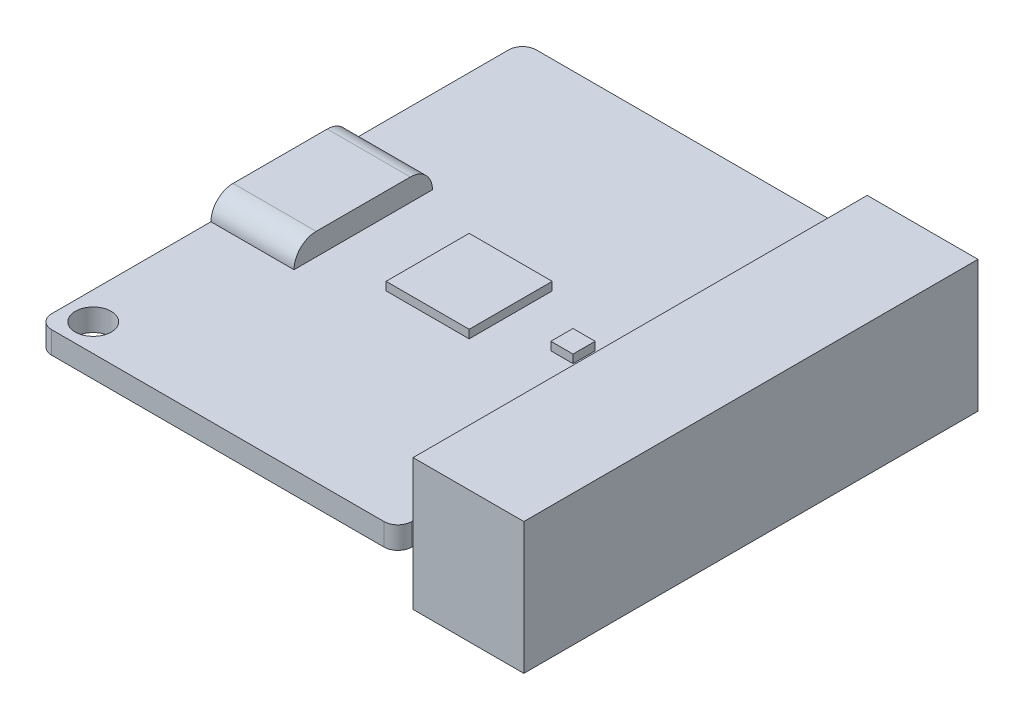
ISO-10303-21;
HEADER;
FILE_DESCRIPTION(('STEP AP214'),'2;1');
FILE_NAME('part.step','',(''),(''),'','','');
FILE_SCHEMA(('AUTOMOTIVE_DESIGN { 1 0 10303 214 1 1 1 1 }'));
ENDSEC;
DATA;
#1=APPLICATION_CONTEXT('core data for automotive mechanical design processes');
#2=APPLICATION_PROTOCOL_DEFINITION('international standard','automotive_design',2000,#1);
#3=PRODUCT_CONTEXT('',#1,'mechanical');
#4=PRODUCT('Part','Part','',(#3));
#5=PRODUCT_RELATED_PRODUCT_CATEGORY('part','',(#4));
#6=PRODUCT_DEFINITION_FORMATION('','',#4);
#7=PRODUCT_DEFINITION_CONTEXT('part definition',#1,'design');
#8=PRODUCT_DEFINITION('design','',#6,#7);
#9=PRODUCT_DEFINITION_SHAPE('','',#8);
#10=(LENGTH_UNIT() NAMED_UNIT(*) SI_UNIT(.MILLI.,.METRE.));
#11=(NAMED_UNIT(*) PLANE_ANGLE_UNIT() SI_UNIT($,.RADIAN.));
#12=(NAMED_UNIT(*) SI_UNIT($,.STERADIAN.) SOLID_ANGLE_UNIT());
#13=UNCERTAINTY_MEASURE_WITH_UNIT(LENGTH_MEASURE(1.E-05),#10,'distance_accuracy_value','');
#14=(GEOMETRIC_REPRESENTATION_CONTEXT(3) GLOBAL_UNCERTAINTY_ASSIGNED_CONTEXT((#13)) GLOBAL_UNIT_ASSIGNED_CONTEXT((#10,
#11,#12)) REPRESENTATION_CONTEXT('',''));
#15=CARTESIAN_POINT('',(0.,0.,0.));
#16=DIRECTION('',(0.,0.,1.));
#17=DIRECTION('',(1.,0.,0.));
#18=AXIS2_PLACEMENT_3D('',#15,#16,#17);
#19=CARTESIAN_POINT('',(13.,1.6,16.5));
#20=DIRECTION('',(-1.,0.,0.));
#21=DIRECTION('',(0.,0.,1.));
#22=AXIS2_PLACEMENT_3D('',#19,#20,#21);
#23=PLANE('',#22);
#24=DIRECTION('',(0.,1.,0.));
#25=VECTOR('',#24,1.);
#26=CARTESIAN_POINT('',(13.,1.6,-16.4));
#27=LINE('',#26,#25);
#28=CARTESIAN_POINT('',(13.,0.,-16.4));
#29=VERTEX_POINT('',#28);
#30=CARTESIAN_POINT('',(13.,1.6,-16.4));
#31=VERTEX_POINT('',#30);
#32=EDGE_CURVE('E11',#29,#31,#27,.T.);
#33=ORIENTED_EDGE('',*,*,#32,.F.);
#34=DIRECTION('',(0.,0.,-1.));
#35=VECTOR('',#34,1.);
#36=CARTESIAN_POINT('',(13.,0.,16.5));
#37=LINE('',#36,#35);
#38=CARTESIAN_POINT('',(13.,0.,-16.5));
#39=VERTEX_POINT('',#38);
#40=EDGE_CURVE('E380',#29,#39,#37,.T.);
#41=ORIENTED_EDGE('',*,*,#40,.T.);
#42=DIRECTION('',(0.,-1.,0.));
#43=VECTOR('',#42,1.);
#44=CARTESIAN_POINT('',(13.,1.6,-16.5));
#45=LINE('',#44,#43);
#46=CARTESIAN_POINT('',(13.,1.6,-16.5));
#47=VERTEX_POINT('',#46);
#48=EDGE_CURVE('E392',#47,#39,#45,.T.);
#49=ORIENTED_EDGE('',*,*,#48,.F.);
#50=DIRECTION('',(0.,0.,-1.));
#51=VECTOR('',#50,1.);
#52=CARTESIAN_POINT('',(13.,1.6,16.5));
#53=LINE('',#52,#51);
#54=EDGE_CURVE('E52',#31,#47,#53,.T.);
#55=ORIENTED_EDGE('',*,*,#54,.F.);
#56=EDGE_LOOP('',(#33,#41,#49,#55));
#57=FACE_BOUND('',#56,.T.);
#58=ADVANCED_FACE('F37',(#57),#23,.F.);
#59=DIRECTION('',(0.,-1.,0.));
#60=VECTOR('',#59,1.);
#61=CARTESIAN_POINT('',(13.,1.6,16.4));
#62=LINE('',#61,#60);
#63=CARTESIAN_POINT('',(13.,1.6,16.4));
#64=VERTEX_POINT('',#63);
#65=CARTESIAN_POINT('',(13.,0.,16.4));
#66=VERTEX_POINT('',#65);
#67=EDGE_CURVE('E45',#64,#66,#62,.T.);
#68=ORIENTED_EDGE('',*,*,#67,.F.);
#69=CARTESIAN_POINT('',(13.,1.6,16.5));
#70=VERTEX_POINT('',#69);
#71=EDGE_CURVE('E362',#70,#64,#53,.T.);
#72=ORIENTED_EDGE('',*,*,#71,.F.);
#73=DIRECTION('',(0.,-1.,0.));
#74=VECTOR('',#73,1.);
#75=CARTESIAN_POINT('',(13.,1.6,16.5));
#76=LINE('',#75,#74);
#77=CARTESIAN_POINT('',(13.,0.,16.5));
#78=VERTEX_POINT('',#77);
#79=EDGE_CURVE('E395',#70,#78,#76,.T.);
#80=ORIENTED_EDGE('',*,*,#79,.T.);
#81=EDGE_CURVE('E381',#78,#66,#37,.T.);
#82=ORIENTED_EDGE('',*,*,#81,.T.);
#83=EDGE_LOOP('',(#68,#72,#80,#82));
#84=FACE_BOUND('',#83,.T.);
#85=ADVANCED_FACE('F463',(#84),#23,.F.);
#86=CARTESIAN_POINT('',(-12.,1.6,-16.5));
#87=DIRECTION('',(0.,-1.,0.));
#88=DIRECTION('',(0.,0.,-1.));
#89=AXIS2_PLACEMENT_3D('',#86,#87,#88);
#90=PLANE('',#89);
#91=DIRECTION('',(0.,0.,1.));
#92=VECTOR('',#91,1.);
#93=CARTESIAN_POINT('',(-2.35000000000001,1.6,-3.));
#94=LINE('',#93,#92);
#95=CARTESIAN_POINT('',(-2.35000000000001,1.6,-3.));
#96=VERTEX_POINT('',#95);
#97=CARTESIAN_POINT('',(-2.35,1.6,3.));
#98=VERTEX_POINT('',#97);
#99=EDGE_CURVE('E274',#96,#98,#94,.T.);
#100=ORIENTED_EDGE('',*,*,#99,.F.);
#101=DIRECTION('',(-1.,0.,0.));
#102=VECTOR('',#101,1.);
#103=CARTESIAN_POINT('',(3.65,1.6,-3.));
#104=LINE('',#103,#102);
#105=CARTESIAN_POINT('',(3.65,1.6,-3.));
#106=VERTEX_POINT('',#105);
#107=EDGE_CURVE('E279',#106,#96,#104,.T.);
#108=ORIENTED_EDGE('',*,*,#107,.F.);
#109=DIRECTION('',(0.,0.,-1.));
#110=VECTOR('',#109,1.);
#111=CARTESIAN_POINT('',(3.65,1.6,-3.));
#112=LINE('',#111,#110);
#113=CARTESIAN_POINT('',(3.65,1.6,3.));
#114=VERTEX_POINT('',#113);
#115=EDGE_CURVE('E291',#114,#106,#112,.T.);
#116=ORIENTED_EDGE('',*,*,#115,.F.);
#117=DIRECTION('',(1.,0.,0.));
#118=VECTOR('',#117,1.);
#119=CARTESIAN_POINT('',(3.65,1.6,3.));
#120=LINE('',#119,#118);
#121=EDGE_CURVE('E288',#98,#114,#120,.T.);
#122=ORIENTED_EDGE('',*,*,#121,.F.);
#123=EDGE_LOOP('',(#100,#108,#116,#122));
#124=FACE_BOUND('',#123,.T.);
#125=DIRECTION('',(0.,0.,1.));
#126=VECTOR('',#125,1.);
#127=CARTESIAN_POINT('',(-13.,1.6,16.5));
#128=LINE('',#127,#126);
#129=CARTESIAN_POINT('',(-13.,1.6,-16.5));
#130=VERTEX_POINT('',#129);
#131=CARTESIAN_POINT('',(-13.,1.6,-5.));
#132=VERTEX_POINT('',#131);
#133=EDGE_CURVE('E354',#130,#132,#128,.T.);
#134=ORIENTED_EDGE('',*,*,#133,.T.);
#135=DIRECTION('',(-1.,0.,0.));
#136=VECTOR('',#135,1.);
#137=CARTESIAN_POINT('',(-7.00000000000001,1.6,-5.));
#138=LINE('',#137,#136);
#139=CARTESIAN_POINT('',(-7.00000000000001,1.6,-5.));
#140=VERTEX_POINT('',#139);
#141=EDGE_CURVE('E331',#132,#140,#138,.F.);
#142=ORIENTED_EDGE('',*,*,#141,.T.);
#143=DIRECTION('',(0.,0.,-1.));
#144=VECTOR('',#143,1.);
#145=CARTESIAN_POINT('',(-7.00000000000001,1.6,-16.5));
#146=LINE('',#145,#144);
#147=CARTESIAN_POINT('',(-7.00000000000001,1.6,5.));
#148=VERTEX_POINT('',#147);
#149=EDGE_CURVE('E333',#148,#140,#146,.T.);
#150=ORIENTED_EDGE('',*,*,#149,.F.);
#151=DIRECTION('',(-1.,0.,0.));
#152=VECTOR('',#151,1.);
#153=CARTESIAN_POINT('',(-7.00000000000001,1.6,5.));
#154=LINE('',#153,#152);
#155=CARTESIAN_POINT('',(-13.,1.6,5.));
#156=VERTEX_POINT('',#155);
#157=EDGE_CURVE('E326',#148,#156,#154,.T.);
#158=ORIENTED_EDGE('',*,*,#157,.T.);
#159=CARTESIAN_POINT('',(-13.,1.6,16.5));
#160=VERTEX_POINT('',#159);
#161=EDGE_CURVE('E352',#156,#160,#128,.T.);
#162=ORIENTED_EDGE('',*,*,#161,.T.);
#163=CARTESIAN_POINT('',(-12.,1.6,16.5));
#164=DIRECTION('',(0.,1.,0.));
#165=DIRECTION('',(0.,0.,-1.));
#166=AXIS2_PLACEMENT_3D('',#163,#164,#165);
#167=CIRCLE('',#166,1.);
#168=CARTESIAN_POINT('',(-12.,1.6,17.5));
#169=VERTEX_POINT('',#168);
#170=EDGE_CURVE('E356',#160,#169,#167,.T.);
#171=ORIENTED_EDGE('',*,*,#170,.T.);
#172=DIRECTION('',(1.,0.,0.));
#173=VECTOR('',#172,1.);
#174=CARTESIAN_POINT('',(-12.,1.6,17.5));
#175=LINE('',#174,#173);
#176=CARTESIAN_POINT('',(12.,1.6,17.5));
#177=VERTEX_POINT('',#176);
#178=EDGE_CURVE('E358',#169,#177,#175,.T.);
#179=ORIENTED_EDGE('',*,*,#178,.T.);
#180=CARTESIAN_POINT('',(12.,1.6,16.5));
#181=DIRECTION('',(0.,1.,0.));
#182=DIRECTION('',(0.,0.,1.));
#183=AXIS2_PLACEMENT_3D('',#180,#181,#182);
#184=CIRCLE('',#183,1.);
#185=EDGE_CURVE('E360',#177,#70,#184,.T.);
#186=ORIENTED_EDGE('',*,*,#185,.T.);
#187=ORIENTED_EDGE('',*,*,#71,.T.);
#188=EDGE_CURVE('E365',#64,#31,#53,.T.);
#189=ORIENTED_EDGE('',*,*,#188,.T.);
#190=ORIENTED_EDGE('',*,*,#54,.T.);
#191=CARTESIAN_POINT('',(12.,1.6,-16.5));
#192=DIRECTION('',(0.,1.,0.));
#193=DIRECTION('',(0.,0.,-1.));
#194=AXIS2_PLACEMENT_3D('',#191,#192,#193);
#195=CIRCLE('',#194,1.);
#196=CARTESIAN_POINT('',(12.,1.6,-17.5));
#197=VERTEX_POINT('',#196);
#198=EDGE_CURVE('E364',#47,#197,#195,.T.);
#199=ORIENTED_EDGE('',*,*,#198,.T.);
#200=DIRECTION('',(-1.,0.,0.));
#201=VECTOR('',#200,1.);
#202=CARTESIAN_POINT('',(-12.,1.6,-17.5));
#203=LINE('',#202,#201);
#204=CARTESIAN_POINT('',(-12.,1.6,-17.5));
#205=VERTEX_POINT('',#204);
#206=EDGE_CURVE('E367',#197,#205,#203,.T.);
#207=ORIENTED_EDGE('',*,*,#206,.T.);
#208=CARTESIAN_POINT('',(-12.,1.6,-16.5));
#209=DIRECTION('',(0.,1.,0.));
#210=DIRECTION('',(0.,0.,-1.));
#211=AXIS2_PLACEMENT_3D('',#208,#209,#210);
#212=CIRCLE('',#211,1.);
#213=EDGE_CURVE('E349',#205,#130,#212,.T.);
#214=ORIENTED_EDGE('',*,*,#213,.T.);
#215=EDGE_LOOP('',(#134,#142,#150,#158,#162,#171,#179,#186,#187,#189,#190,#199,#207,#214));
#216=FACE_BOUND('',#215,.T.);
#217=CARTESIAN_POINT('',(-11.,1.6,15.5));
#218=DIRECTION('',(0.,1.,0.));
#219=DIRECTION('',(0.,0.,1.));
#220=AXIS2_PLACEMENT_3D('',#217,#218,#219);
#221=CIRCLE('',#220,1.3);
#222=CARTESIAN_POINT('',(-11.,1.6,16.8));
#223=VERTEX_POINT('',#222);
#224=EDGE_CURVE('E343',#223,#223,#221,.T.);
#225=ORIENTED_EDGE('',*,*,#224,.F.);
#226=EDGE_LOOP('',(#225));
#227=FACE_BOUND('',#226,.T.);
#228=CARTESIAN_POINT('',(11.,1.6,-15.5));
#229=DIRECTION('',(0.,1.,0.));
#230=DIRECTION('',(0.,0.,1.));
#231=AXIS2_PLACEMENT_3D('',#228,#229,#230);
#232=CIRCLE('',#231,1.3);
#233=CARTESIAN_POINT('',(11.,1.6,-14.2));
#234=VERTEX_POINT('',#233);
#235=EDGE_CURVE('E337',#234,#234,#232,.T.);
#236=ORIENTED_EDGE('',*,*,#235,.F.);
#237=EDGE_LOOP('',(#236));
#238=FACE_BOUND('',#237,.T.);
#239=DIRECTION('',(0.,0.,1.));
#240=VECTOR('',#239,1.);
#241=CARTESIAN_POINT('',(7.34999999999999,1.6,-0.8));
#242=LINE('',#241,#240);
#243=CARTESIAN_POINT('',(7.34999999999999,1.6,-0.8));
#244=VERTEX_POINT('',#243);
#245=CARTESIAN_POINT('',(7.34999999999999,1.6,0.799999999999997));
#246=VERTEX_POINT('',#245);
#247=EDGE_CURVE('E236',#244,#246,#242,.T.);
#248=ORIENTED_EDGE('',*,*,#247,.F.);
#249=DIRECTION('',(-1.,0.,0.));
#250=VECTOR('',#249,1.);
#251=CARTESIAN_POINT('',(8.94999999999999,1.6,-0.8));
#252=LINE('',#251,#250);
#253=CARTESIAN_POINT('',(8.94999999999999,1.6,-0.8));
#254=VERTEX_POINT('',#253);
#255=EDGE_CURVE('E249',#254,#244,#252,.T.);
#256=ORIENTED_EDGE('',*,*,#255,.F.);
#257=DIRECTION('',(0.,0.,-1.));
#258=VECTOR('',#257,1.);
#259=CARTESIAN_POINT('',(8.94999999999999,1.6,-0.8));
#260=LINE('',#259,#258);
#261=CARTESIAN_POINT('',(8.95,1.6,0.799999999999999));
#262=VERTEX_POINT('',#261);
#263=EDGE_CURVE('E258',#262,#254,#260,.T.);
#264=ORIENTED_EDGE('',*,*,#263,.F.);
#265=DIRECTION('',(1.,0.,0.));
#266=VECTOR('',#265,1.);
#267=CARTESIAN_POINT('',(8.94999999999999,1.6,0.8));
#268=LINE('',#267,#266);
#269=EDGE_CURVE('E239',#246,#262,#268,.T.);
#270=ORIENTED_EDGE('',*,*,#269,.F.);
#271=EDGE_LOOP('',(#248,#256,#264,#270));
#272=FACE_BOUND('',#271,.T.);
#273=ADVANCED_FACE('F458',(#124,#216,#227,#238,#272),#90,.F.);
#274=CARTESIAN_POINT('',(-12.,0.,-16.5));
#275=DIRECTION('',(0.,-1.,0.));
#276=DIRECTION('',(0.,0.,-1.));
#277=AXIS2_PLACEMENT_3D('',#274,#275,#276);
#278=PLANE('',#277);
#279=CARTESIAN_POINT('',(-12.,0.,16.5));
#280=DIRECTION('',(0.,1.,0.));
#281=DIRECTION('',(0.,0.,-1.));
#282=AXIS2_PLACEMENT_3D('',#279,#280,#281);
#283=CIRCLE('',#282,1.);
#284=CARTESIAN_POINT('',(-13.,0.,16.5));
#285=VERTEX_POINT('',#284);
#286=CARTESIAN_POINT('',(-12.,0.,17.5));
#287=VERTEX_POINT('',#286);
#288=EDGE_CURVE('E374',#285,#287,#283,.T.);
#289=ORIENTED_EDGE('',*,*,#288,.F.);
#290=DIRECTION('',(0.,0.,1.));
#291=VECTOR('',#290,1.);
#292=CARTESIAN_POINT('',(-13.,0.,16.5));
#293=LINE('',#292,#291);
#294=CARTESIAN_POINT('',(-13.,0.,-16.5));
#295=VERTEX_POINT('',#294);
#296=EDGE_CURVE('E372',#295,#285,#293,.T.);
#297=ORIENTED_EDGE('',*,*,#296,.F.);
#298=CARTESIAN_POINT('',(-12.,0.,-16.5));
#299=DIRECTION('',(0.,1.,0.));
#300=DIRECTION('',(0.,0.,-1.));
#301=AXIS2_PLACEMENT_3D('',#298,#299,#300);
#302=CIRCLE('',#301,1.);
#303=CARTESIAN_POINT('',(-12.,0.,-17.5));
#304=VERTEX_POINT('',#303);
#305=EDGE_CURVE('E346',#304,#295,#302,.T.);
#306=ORIENTED_EDGE('',*,*,#305,.F.);
#307=DIRECTION('',(-1.,0.,0.));
#308=VECTOR('',#307,1.);
#309=CARTESIAN_POINT('',(-12.,0.,-17.5));
#310=LINE('',#309,#308);
#311=CARTESIAN_POINT('',(12.,0.,-17.5));
#312=VERTEX_POINT('',#311);
#313=EDGE_CURVE('E353',#312,#304,#310,.T.);
#314=ORIENTED_EDGE('',*,*,#313,.F.);
#315=CARTESIAN_POINT('',(12.,0.,-16.5));
#316=DIRECTION('',(0.,1.,0.));
#317=DIRECTION('',(0.,0.,-1.));
#318=AXIS2_PLACEMENT_3D('',#315,#316,#317);
#319=CIRCLE('',#318,1.);
#320=EDGE_CURVE('E383',#39,#312,#319,.T.);
#321=ORIENTED_EDGE('',*,*,#320,.F.);
#322=ORIENTED_EDGE('',*,*,#40,.F.);
#323=EDGE_CURVE('E384',#66,#29,#37,.T.);
#324=ORIENTED_EDGE('',*,*,#323,.F.);
#325=ORIENTED_EDGE('',*,*,#81,.F.);
#326=CARTESIAN_POINT('',(12.,0.,16.5));
#327=DIRECTION('',(0.,1.,0.));
#328=DIRECTION('',(0.,0.,1.));
#329=AXIS2_PLACEMENT_3D('',#326,#327,#328);
#330=CIRCLE('',#329,1.);
#331=CARTESIAN_POINT('',(12.,0.,17.5));
#332=VERTEX_POINT('',#331);
#333=EDGE_CURVE('E378',#332,#78,#330,.T.);
#334=ORIENTED_EDGE('',*,*,#333,.F.);
#335=DIRECTION('',(1.,0.,0.));
#336=VECTOR('',#335,1.);
#337=CARTESIAN_POINT('',(-12.,0.,17.5));
#338=LINE('',#337,#336);
#339=EDGE_CURVE('E376',#287,#332,#338,.T.);
#340=ORIENTED_EDGE('',*,*,#339,.F.);
#341=EDGE_LOOP('',(#289,#297,#306,#314,#321,#322,#324,#325,#334,#340));
#342=FACE_BOUND('',#341,.T.);
#343=CARTESIAN_POINT('',(-11.,0.,15.5));
#344=DIRECTION('',(0.,1.,0.));
#345=DIRECTION('',(0.,0.,1.));
#346=AXIS2_PLACEMENT_3D('',#343,#344,#345);
#347=CIRCLE('',#346,1.3);
#348=CARTESIAN_POINT('',(-11.,0.,16.8));
#349=VERTEX_POINT('',#348);
#350=EDGE_CURVE('E340',#349,#349,#347,.T.);
#351=ORIENTED_EDGE('',*,*,#350,.T.);
#352=EDGE_LOOP('',(#351));
#353=FACE_BOUND('',#352,.T.);
#354=CARTESIAN_POINT('',(11.,0.,-15.5));
#355=DIRECTION('',(0.,1.,0.));
#356=DIRECTION('',(0.,0.,1.));
#357=AXIS2_PLACEMENT_3D('',#354,#355,#356);
#358=CIRCLE('',#357,1.3);
#359=CARTESIAN_POINT('',(11.,0.,-14.2));
#360=VERTEX_POINT('',#359);
#361=EDGE_CURVE('E336',#360,#360,#358,.T.);
#362=ORIENTED_EDGE('',*,*,#361,.T.);
#363=EDGE_LOOP('',(#362));
#364=FACE_BOUND('',#363,.T.);
#365=ADVANCED_FACE('F443',(#342,#353,#364),#278,.T.);
#366=CARTESIAN_POINT('',(-12.,1.6,-16.5));
#367=DIRECTION('',(0.,-1.,0.));
#368=DIRECTION('',(0.,0.,-1.));
#369=AXIS2_PLACEMENT_3D('',#366,#367,#368);
#370=CYLINDRICAL_SURFACE('',#369,1.);
#371=ORIENTED_EDGE('',*,*,#305,.T.);
#372=DIRECTION('',(0.,-1.,0.));
#373=VECTOR('',#372,1.);
#374=CARTESIAN_POINT('',(-13.,1.6,-16.5));
#375=LINE('',#374,#373);
#376=EDGE_CURVE('E407',#130,#295,#375,.T.);
#377=ORIENTED_EDGE('',*,*,#376,.F.);
#378=ORIENTED_EDGE('',*,*,#213,.F.);
#379=DIRECTION('',(0.,-1.,0.));
#380=VECTOR('',#379,1.);
#381=CARTESIAN_POINT('',(-12.,1.6,-17.5));
#382=LINE('',#381,#380);
#383=EDGE_CURVE('E369',#205,#304,#382,.T.);
#384=ORIENTED_EDGE('',*,*,#383,.T.);
#385=EDGE_LOOP('',(#371,#377,#378,#384));
#386=FACE_BOUND('',#385,.T.);
#387=ADVANCED_FACE('F39',(#386),#370,.T.);
#388=CARTESIAN_POINT('',(-13.,1.6,16.5));
#389=DIRECTION('',(1.,0.,0.));
#390=DIRECTION('',(0.,0.,-1.));
#391=AXIS2_PLACEMENT_3D('',#388,#389,#390);
#392=PLANE('',#391);
#393=ORIENTED_EDGE('',*,*,#161,.F.);
#394=CARTESIAN_POINT('',(-13.,1.6,3.4));
#395=DIRECTION('',(-1.,0.,0.));
#396=DIRECTION('',(0.,0.,1.));
#397=AXIS2_PLACEMENT_3D('',#394,#395,#396);
#398=CIRCLE('',#397,1.6);
#399=CARTESIAN_POINT('',(-13.,3.2,3.4));
#400=VERTEX_POINT('',#399);
#401=EDGE_CURVE('E320',#156,#400,#398,.T.);
#402=ORIENTED_EDGE('',*,*,#401,.T.);
#403=DIRECTION('',(0.,0.,-1.));
#404=VECTOR('',#403,1.);
#405=CARTESIAN_POINT('',(-13.,3.2,-3.4));
#406=LINE('',#405,#404);
#407=CARTESIAN_POINT('',(-13.,3.2,-3.4));
#408=VERTEX_POINT('',#407);
#409=EDGE_CURVE('E312',#400,#408,#406,.T.);
#410=ORIENTED_EDGE('',*,*,#409,.T.);
#411=CARTESIAN_POINT('',(-13.,1.6,-3.4));
#412=DIRECTION('',(-1.,0.,0.));
#413=DIRECTION('',(0.,0.,1.));
#414=AXIS2_PLACEMENT_3D('',#411,#412,#413);
#415=CIRCLE('',#414,1.6);
#416=EDGE_CURVE('E307',#408,#132,#415,.T.);
#417=ORIENTED_EDGE('',*,*,#416,.T.);
#418=ORIENTED_EDGE('',*,*,#133,.F.);
#419=ORIENTED_EDGE('',*,*,#376,.T.);
#420=ORIENTED_EDGE('',*,*,#296,.T.);
#421=DIRECTION('',(0.,-1.,0.));
#422=VECTOR('',#421,1.);
#423=CARTESIAN_POINT('',(-13.,1.6,16.5));
#424=LINE('',#423,#422);
#425=EDGE_CURVE('E404',#160,#285,#424,.T.);
#426=ORIENTED_EDGE('',*,*,#425,.F.);
#427=EDGE_LOOP('',(#393,#402,#410,#417,#418,#419,#420,#426));
#428=FACE_BOUND('',#427,.T.);
#429=ADVANCED_FACE('F478',(#428),#392,.F.);
#430=CARTESIAN_POINT('',(-12.,1.6,16.5));
#431=DIRECTION('',(0.,-1.,0.));
#432=DIRECTION('',(0.,0.,-1.));
#433=AXIS2_PLACEMENT_3D('',#430,#431,#432);
#434=CYLINDRICAL_SURFACE('',#433,1.);
#435=ORIENTED_EDGE('',*,*,#288,.T.);
#436=DIRECTION('',(0.,-1.,0.));
#437=VECTOR('',#436,1.);
#438=CARTESIAN_POINT('',(-12.,1.6,17.5));
#439=LINE('',#438,#437);
#440=EDGE_CURVE('E401',#169,#287,#439,.T.);
#441=ORIENTED_EDGE('',*,*,#440,.F.);
#442=ORIENTED_EDGE('',*,*,#170,.F.);
#443=ORIENTED_EDGE('',*,*,#425,.T.);
#444=EDGE_LOOP('',(#435,#441,#442,#443));
#445=FACE_BOUND('',#444,.T.);
#446=ADVANCED_FACE('F475',(#445),#434,.T.);
#447=CARTESIAN_POINT('',(-12.,1.6,17.5));
#448=DIRECTION('',(0.,0.,-1.));
#449=DIRECTION('',(-1.,0.,0.));
#450=AXIS2_PLACEMENT_3D('',#447,#448,#449);
#451=PLANE('',#450);
#452=ORIENTED_EDGE('',*,*,#339,.T.);
#453=DIRECTION('',(0.,-1.,0.));
#454=VECTOR('',#453,1.);
#455=CARTESIAN_POINT('',(12.,1.6,17.5));
#456=LINE('',#455,#454);
#457=EDGE_CURVE('E398',#177,#332,#456,.T.);
#458=ORIENTED_EDGE('',*,*,#457,.F.);
#459=ORIENTED_EDGE('',*,*,#178,.F.);
#460=ORIENTED_EDGE('',*,*,#440,.T.);
#461=EDGE_LOOP('',(#452,#458,#459,#460));
#462=FACE_BOUND('',#461,.T.);
#463=ADVANCED_FACE('F471',(#462),#451,.F.);
#464=CARTESIAN_POINT('',(12.,1.6,16.5));
#465=DIRECTION('',(0.,-1.,0.));
#466=DIRECTION('',(0.,0.,-1.));
#467=AXIS2_PLACEMENT_3D('',#464,#465,#466);
#468=CYLINDRICAL_SURFACE('',#467,1.);
#469=ORIENTED_EDGE('',*,*,#333,.T.);
#470=ORIENTED_EDGE('',*,*,#79,.F.);
#471=ORIENTED_EDGE('',*,*,#185,.F.);
#472=ORIENTED_EDGE('',*,*,#457,.T.);
#473=EDGE_LOOP('',(#469,#470,#471,#472));
#474=FACE_BOUND('',#473,.T.);
#475=ADVANCED_FACE('F467',(#474),#468,.T.);
#476=CARTESIAN_POINT('',(12.,1.6,-16.5));
#477=DIRECTION('',(0.,-1.,0.));
#478=DIRECTION('',(0.,0.,-1.));
#479=AXIS2_PLACEMENT_3D('',#476,#477,#478);
#480=CYLINDRICAL_SURFACE('',#479,1.);
#481=ORIENTED_EDGE('',*,*,#320,.T.);
#482=DIRECTION('',(0.,-1.,0.));
#483=VECTOR('',#482,1.);
#484=CARTESIAN_POINT('',(12.,1.6,-17.5));
#485=LINE('',#484,#483);
#486=EDGE_CURVE('E389',#197,#312,#485,.T.);
#487=ORIENTED_EDGE('',*,*,#486,.F.);
#488=ORIENTED_EDGE('',*,*,#198,.F.);
#489=ORIENTED_EDGE('',*,*,#48,.T.);
#490=EDGE_LOOP('',(#481,#487,#488,#489));
#491=FACE_BOUND('',#490,.T.);
#492=ADVANCED_FACE('F450',(#491),#480,.T.);
#493=CARTESIAN_POINT('',(-12.,1.6,-17.5));
#494=DIRECTION('',(0.,0.,1.));
#495=DIRECTION('',(1.,0.,0.));
#496=AXIS2_PLACEMENT_3D('',#493,#494,#495);
#497=PLANE('',#496);
#498=ORIENTED_EDGE('',*,*,#313,.T.);
#499=ORIENTED_EDGE('',*,*,#383,.F.);
#500=ORIENTED_EDGE('',*,*,#206,.F.);
#501=ORIENTED_EDGE('',*,*,#486,.T.);
#502=EDGE_LOOP('',(#498,#499,#500,#501));
#503=FACE_BOUND('',#502,.T.);
#504=ADVANCED_FACE('F454',(#503),#497,.F.);
#505=CARTESIAN_POINT('',(-11.,1.6,15.5));
#506=DIRECTION('',(0.,-1.,0.));
#507=DIRECTION('',(0.,0.,-1.));
#508=AXIS2_PLACEMENT_3D('',#505,#506,#507);
#509=CYLINDRICAL_SURFACE('',#508,1.3);
#510=ORIENTED_EDGE('',*,*,#224,.T.);
#511=EDGE_LOOP('',(#510));
#512=FACE_BOUND('',#511,.T.);
#513=ORIENTED_EDGE('',*,*,#350,.F.);
#514=EDGE_LOOP('',(#513));
#515=FACE_BOUND('',#514,.T.);
#516=ADVANCED_FACE('F522',(#512,#515),#509,.F.);
#517=CARTESIAN_POINT('',(11.,1.6,-15.5));
#518=DIRECTION('',(0.,-1.,0.));
#519=DIRECTION('',(0.,0.,-1.));
#520=AXIS2_PLACEMENT_3D('',#517,#518,#519);
#521=CYLINDRICAL_SURFACE('',#520,1.3);
#522=ORIENTED_EDGE('',*,*,#235,.T.);
#523=EDGE_LOOP('',(#522));
#524=FACE_BOUND('',#523,.T.);
#525=ORIENTED_EDGE('',*,*,#361,.F.);
#526=EDGE_LOOP('',(#525));
#527=FACE_BOUND('',#526,.T.);
#528=ADVANCED_FACE('F528',(#524,#527),#521,.F.);
#529=CARTESIAN_POINT('',(-7.00000000000001,1.6,-3.4));
#530=DIRECTION('',(-1.,0.,0.));
#531=DIRECTION('',(0.,0.,1.));
#532=AXIS2_PLACEMENT_3D('',#529,#530,#531);
#533=PLANE('',#532);
#534=CARTESIAN_POINT('',(-7.00000000000001,1.6,3.4));
#535=DIRECTION('',(-1.,0.,0.));
#536=DIRECTION('',(0.,0.,1.));
#537=AXIS2_PLACEMENT_3D('',#534,#535,#536);
#538=CIRCLE('',#537,1.6);
#539=CARTESIAN_POINT('',(-7.00000000000001,3.2,3.4));
#540=VERTEX_POINT('',#539);
#541=EDGE_CURVE('E311',#148,#540,#538,.T.);
#542=ORIENTED_EDGE('',*,*,#541,.F.);
#543=ORIENTED_EDGE('',*,*,#149,.T.);
#544=CARTESIAN_POINT('',(-7.00000000000001,1.6,-3.4));
#545=DIRECTION('',(-1.,0.,0.));
#546=DIRECTION('',(0.,0.,1.));
#547=AXIS2_PLACEMENT_3D('',#544,#545,#546);
#548=CIRCLE('',#547,1.6);
#549=CARTESIAN_POINT('',(-7.00000000000001,3.2,-3.4));
#550=VERTEX_POINT('',#549);
#551=EDGE_CURVE('E308',#550,#140,#548,.T.);
#552=ORIENTED_EDGE('',*,*,#551,.F.);
#553=DIRECTION('',(0.,0.,-1.));
#554=VECTOR('',#553,1.);
#555=CARTESIAN_POINT('',(-7.00000000000001,3.2,-3.4));
#556=LINE('',#555,#554);
#557=EDGE_CURVE('E314',#540,#550,#556,.T.);
#558=ORIENTED_EDGE('',*,*,#557,.F.);
#559=EDGE_LOOP('',(#542,#543,#552,#558));
#560=FACE_BOUND('',#559,.T.);
#561=ADVANCED_FACE('F536',(#560),#533,.F.);
#562=CARTESIAN_POINT('',(-7.00000000000001,1.6,-3.4));
#563=DIRECTION('',(-1.,0.,0.));
#564=DIRECTION('',(0.,0.,1.));
#565=AXIS2_PLACEMENT_3D('',#562,#563,#564);
#566=CYLINDRICAL_SURFACE('',#565,1.6);
#567=ORIENTED_EDGE('',*,*,#141,.F.);
#568=ORIENTED_EDGE('',*,*,#416,.F.);
#569=DIRECTION('',(-1.,0.,0.));
#570=VECTOR('',#569,1.);
#571=CARTESIAN_POINT('',(-7.00000000000001,3.2,-3.4));
#572=LINE('',#571,#570);
#573=EDGE_CURVE('E324',#550,#408,#572,.T.);
#574=ORIENTED_EDGE('',*,*,#573,.F.);
#575=ORIENTED_EDGE('',*,*,#551,.T.);
#576=EDGE_LOOP('',(#567,#568,#574,#575));
#577=FACE_BOUND('',#576,.T.);
#578=ADVANCED_FACE('F544',(#577),#566,.T.);
#579=CARTESIAN_POINT('',(-7.00000000000001,1.6,3.4));
#580=DIRECTION('',(-1.,0.,0.));
#581=DIRECTION('',(0.,0.,1.));
#582=AXIS2_PLACEMENT_3D('',#579,#580,#581);
#583=CYLINDRICAL_SURFACE('',#582,1.6);
#584=ORIENTED_EDGE('',*,*,#157,.F.);
#585=ORIENTED_EDGE('',*,*,#541,.T.);
#586=DIRECTION('',(-1.,0.,0.));
#587=VECTOR('',#586,1.);
#588=CARTESIAN_POINT('',(-7.00000000000001,3.2,3.4));
#589=LINE('',#588,#587);
#590=EDGE_CURVE('E317',#540,#400,#589,.T.);
#591=ORIENTED_EDGE('',*,*,#590,.T.);
#592=ORIENTED_EDGE('',*,*,#401,.F.);
#593=EDGE_LOOP('',(#584,#585,#591,#592));
#594=FACE_BOUND('',#593,.T.);
#595=ADVANCED_FACE('F552',(#594),#583,.T.);
#596=CARTESIAN_POINT('',(-7.00000000000001,3.2,-3.4));
#597=DIRECTION('',(0.,1.,0.));
#598=DIRECTION('',(0.,0.,1.));
#599=AXIS2_PLACEMENT_3D('',#596,#597,#598);
#600=PLANE('',#599);
#601=ORIENTED_EDGE('',*,*,#409,.F.);
#602=ORIENTED_EDGE('',*,*,#590,.F.);
#603=ORIENTED_EDGE('',*,*,#557,.T.);
#604=ORIENTED_EDGE('',*,*,#573,.T.);
#605=EDGE_LOOP('',(#601,#602,#603,#604));
#606=FACE_BOUND('',#605,.T.);
#607=ADVANCED_FACE('F560',(#606),#600,.T.);
#608=CARTESIAN_POINT('',(-2.35000000000001,2.2,-3.));
#609=DIRECTION('',(1.,0.,0.));
#610=DIRECTION('',(0.,0.,-1.));
#611=AXIS2_PLACEMENT_3D('',#608,#609,#610);
#612=PLANE('',#611);
#613=ORIENTED_EDGE('',*,*,#99,.T.);
#614=DIRECTION('',(0.,-1.,0.));
#615=VECTOR('',#614,1.);
#616=CARTESIAN_POINT('',(-2.35,2.2,3.));
#617=LINE('',#616,#615);
#618=CARTESIAN_POINT('',(-2.35,2.2,3.));
#619=VERTEX_POINT('',#618);
#620=EDGE_CURVE('E304',#619,#98,#617,.T.);
#621=ORIENTED_EDGE('',*,*,#620,.F.);
#622=DIRECTION('',(0.,0.,1.));
#623=VECTOR('',#622,1.);
#624=CARTESIAN_POINT('',(-2.35000000000001,2.2,-3.));
#625=LINE('',#624,#623);
#626=CARTESIAN_POINT('',(-2.35000000000001,2.2,-3.));
#627=VERTEX_POINT('',#626);
#628=EDGE_CURVE('E275',#627,#619,#625,.T.);
#629=ORIENTED_EDGE('',*,*,#628,.F.);
#630=DIRECTION('',(0.,-1.,0.));
#631=VECTOR('',#630,1.);
#632=CARTESIAN_POINT('',(-2.35000000000001,2.2,-3.));
#633=LINE('',#632,#631);
#634=EDGE_CURVE('E285',#627,#96,#633,.T.);
#635=ORIENTED_EDGE('',*,*,#634,.T.);
#636=EDGE_LOOP('',(#613,#621,#629,#635));
#637=FACE_BOUND('',#636,.T.);
#638=ADVANCED_FACE('F568',(#637),#612,.F.);
#639=CARTESIAN_POINT('',(3.65,2.2,3.));
#640=DIRECTION('',(0.,0.,-1.));
#641=DIRECTION('',(-1.,0.,0.));
#642=AXIS2_PLACEMENT_3D('',#639,#640,#641);
#643=PLANE('',#642);
#644=ORIENTED_EDGE('',*,*,#121,.T.);
#645=DIRECTION('',(0.,-1.,0.));
#646=VECTOR('',#645,1.);
#647=CARTESIAN_POINT('',(3.65,2.2,3.));
#648=LINE('',#647,#646);
#649=CARTESIAN_POINT('',(3.65,2.2,3.));
#650=VERTEX_POINT('',#649);
#651=EDGE_CURVE('E301',#650,#114,#648,.T.);
#652=ORIENTED_EDGE('',*,*,#651,.F.);
#653=DIRECTION('',(1.,0.,0.));
#654=VECTOR('',#653,1.);
#655=CARTESIAN_POINT('',(3.65,2.2,3.));
#656=LINE('',#655,#654);
#657=EDGE_CURVE('E278',#619,#650,#656,.T.);
#658=ORIENTED_EDGE('',*,*,#657,.F.);
#659=ORIENTED_EDGE('',*,*,#620,.T.);
#660=EDGE_LOOP('',(#644,#652,#658,#659));
#661=FACE_BOUND('',#660,.T.);
#662=ADVANCED_FACE('F576',(#661),#643,.F.);
#663=CARTESIAN_POINT('',(3.65,2.2,-3.));
#664=DIRECTION('',(-1.,0.,0.));
#665=DIRECTION('',(0.,0.,1.));
#666=AXIS2_PLACEMENT_3D('',#663,#664,#665);
#667=PLANE('',#666);
#668=ORIENTED_EDGE('',*,*,#115,.T.);
#669=DIRECTION('',(0.,-1.,0.));
#670=VECTOR('',#669,1.);
#671=CARTESIAN_POINT('',(3.65,2.2,-3.));
#672=LINE('',#671,#670);
#673=CARTESIAN_POINT('',(3.65,2.2,-3.));
#674=VERTEX_POINT('',#673);
#675=EDGE_CURVE('E298',#674,#106,#672,.T.);
#676=ORIENTED_EDGE('',*,*,#675,.F.);
#677=DIRECTION('',(0.,0.,-1.));
#678=VECTOR('',#677,1.);
#679=CARTESIAN_POINT('',(3.65,2.2,-3.));
#680=LINE('',#679,#678);
#681=EDGE_CURVE('E281',#650,#674,#680,.T.);
#682=ORIENTED_EDGE('',*,*,#681,.F.);
#683=ORIENTED_EDGE('',*,*,#651,.T.);
#684=EDGE_LOOP('',(#668,#676,#682,#683));
#685=FACE_BOUND('',#684,.T.);
#686=ADVANCED_FACE('F584',(#685),#667,.F.);
#687=CARTESIAN_POINT('',(3.65,2.2,-3.));
#688=DIRECTION('',(0.,0.,1.));
#689=DIRECTION('',(1.,0.,0.));
#690=AXIS2_PLACEMENT_3D('',#687,#688,#689);
#691=PLANE('',#690);
#692=ORIENTED_EDGE('',*,*,#107,.T.);
#693=ORIENTED_EDGE('',*,*,#634,.F.);
#694=DIRECTION('',(-1.,0.,0.));
#695=VECTOR('',#694,1.);
#696=CARTESIAN_POINT('',(3.65,2.2,-3.));
#697=LINE('',#696,#695);
#698=EDGE_CURVE('E283',#674,#627,#697,.T.);
#699=ORIENTED_EDGE('',*,*,#698,.F.);
#700=ORIENTED_EDGE('',*,*,#675,.T.);
#701=EDGE_LOOP('',(#692,#693,#699,#700));
#702=FACE_BOUND('',#701,.T.);
#703=ADVANCED_FACE('F592',(#702),#691,.F.);
#704=CARTESIAN_POINT('',(0.,2.2,0.));
#705=DIRECTION('',(0.,-1.,0.));
#706=DIRECTION('',(0.,0.,-1.));
#707=AXIS2_PLACEMENT_3D('',#704,#705,#706);
#708=PLANE('',#707);
#709=ORIENTED_EDGE('',*,*,#628,.T.);
#710=ORIENTED_EDGE('',*,*,#657,.T.);
#711=ORIENTED_EDGE('',*,*,#681,.T.);
#712=ORIENTED_EDGE('',*,*,#698,.T.);
#713=EDGE_LOOP('',(#709,#710,#711,#712));
#714=FACE_BOUND('',#713,.T.);
#715=ADVANCED_FACE('F600',(#714),#708,.F.);
#716=CARTESIAN_POINT('',(7.34999999999999,2.2,-0.8));
#717=DIRECTION('',(1.,0.,0.));
#718=DIRECTION('',(0.,0.,-1.));
#719=AXIS2_PLACEMENT_3D('',#716,#717,#718);
#720=PLANE('',#719);
#721=ORIENTED_EDGE('',*,*,#247,.T.);
#722=DIRECTION('',(0.,-1.,0.));
#723=VECTOR('',#722,1.);
#724=CARTESIAN_POINT('',(7.34999999999999,2.2,0.8));
#725=LINE('',#724,#723);
#726=CARTESIAN_POINT('',(7.34999999999999,2.2,0.8));
#727=VERTEX_POINT('',#726);
#728=EDGE_CURVE('E271',#727,#246,#725,.T.);
#729=ORIENTED_EDGE('',*,*,#728,.F.);
#730=DIRECTION('',(0.,0.,1.));
#731=VECTOR('',#730,1.);
#732=CARTESIAN_POINT('',(7.34999999999999,2.2,-0.8));
#733=LINE('',#732,#731);
#734=CARTESIAN_POINT('',(7.34999999999999,2.2,-0.8));
#735=VERTEX_POINT('',#734);
#736=EDGE_CURVE('E245',#735,#727,#733,.T.);
#737=ORIENTED_EDGE('',*,*,#736,.F.);
#738=DIRECTION('',(0.,-1.,0.));
#739=VECTOR('',#738,1.);
#740=CARTESIAN_POINT('',(7.34999999999999,2.2,-0.8));
#741=LINE('',#740,#739);
#742=EDGE_CURVE('E254',#735,#244,#741,.T.);
#743=ORIENTED_EDGE('',*,*,#742,.T.);
#744=EDGE_LOOP('',(#721,#729,#737,#743));
#745=FACE_BOUND('',#744,.T.);
#746=ADVANCED_FACE('F608',(#745),#720,.F.);
#747=CARTESIAN_POINT('',(8.94999999999999,2.2,0.8));
#748=DIRECTION('',(0.,0.,-1.));
#749=DIRECTION('',(-1.,0.,0.));
#750=AXIS2_PLACEMENT_3D('',#747,#748,#749);
#751=PLANE('',#750);
#752=ORIENTED_EDGE('',*,*,#269,.T.);
#753=DIRECTION('',(0.,-1.,0.));
#754=VECTOR('',#753,1.);
#755=CARTESIAN_POINT('',(8.94999999999999,2.2,0.8));
#756=LINE('',#755,#754);
#757=CARTESIAN_POINT('',(8.94999999999999,2.2,0.8));
#758=VERTEX_POINT('',#757);
#759=EDGE_CURVE('E268',#758,#262,#756,.T.);
#760=ORIENTED_EDGE('',*,*,#759,.F.);
#761=DIRECTION('',(1.,0.,0.));
#762=VECTOR('',#761,1.);
#763=CARTESIAN_POINT('',(8.94999999999999,2.2,0.8));
#764=LINE('',#763,#762);
#765=EDGE_CURVE('E248',#727,#758,#764,.T.);
#766=ORIENTED_EDGE('',*,*,#765,.F.);
#767=ORIENTED_EDGE('',*,*,#728,.T.);
#768=EDGE_LOOP('',(#752,#760,#766,#767));
#769=FACE_BOUND('',#768,.T.);
#770=ADVANCED_FACE('F616',(#769),#751,.F.);
#771=CARTESIAN_POINT('',(8.94999999999999,2.2,-0.8));
#772=DIRECTION('',(-1.,0.,0.));
#773=DIRECTION('',(0.,0.,1.));
#774=AXIS2_PLACEMENT_3D('',#771,#772,#773);
#775=PLANE('',#774);
#776=ORIENTED_EDGE('',*,*,#263,.T.);
#777=DIRECTION('',(0.,-1.,0.));
#778=VECTOR('',#777,1.);
#779=CARTESIAN_POINT('',(8.94999999999999,2.2,-0.8));
#780=LINE('',#779,#778);
#781=CARTESIAN_POINT('',(8.94999999999999,2.2,-0.8));
#782=VERTEX_POINT('',#781);
#783=EDGE_CURVE('E265',#782,#254,#780,.T.);
#784=ORIENTED_EDGE('',*,*,#783,.F.);
#785=DIRECTION('',(0.,0.,-1.));
#786=VECTOR('',#785,1.);
#787=CARTESIAN_POINT('',(8.94999999999999,2.2,-0.8));
#788=LINE('',#787,#786);
#789=EDGE_CURVE('E251',#758,#782,#788,.T.);
#790=ORIENTED_EDGE('',*,*,#789,.F.);
#791=ORIENTED_EDGE('',*,*,#759,.T.);
#792=EDGE_LOOP('',(#776,#784,#790,#791));
#793=FACE_BOUND('',#792,.T.);
#794=ADVANCED_FACE('F624',(#793),#775,.F.);
#795=CARTESIAN_POINT('',(8.94999999999999,2.2,-0.8));
#796=DIRECTION('',(0.,0.,1.));
#797=DIRECTION('',(1.,0.,0.));
#798=AXIS2_PLACEMENT_3D('',#795,#796,#797);
#799=PLANE('',#798);
#800=ORIENTED_EDGE('',*,*,#255,.T.);
#801=ORIENTED_EDGE('',*,*,#742,.F.);
#802=DIRECTION('',(-1.,0.,0.));
#803=VECTOR('',#802,1.);
#804=CARTESIAN_POINT('',(8.94999999999999,2.2,-0.8));
#805=LINE('',#804,#803);
#806=EDGE_CURVE('E253',#782,#735,#805,.T.);
#807=ORIENTED_EDGE('',*,*,#806,.F.);
#808=ORIENTED_EDGE('',*,*,#783,.T.);
#809=EDGE_LOOP('',(#800,#801,#807,#808));
#810=FACE_BOUND('',#809,.T.);
#811=ADVANCED_FACE('F632',(#810),#799,.F.);
#812=CARTESIAN_POINT('',(0.,2.2,0.));
#813=DIRECTION('',(0.,-1.,0.));
#814=DIRECTION('',(0.,0.,-1.));
#815=AXIS2_PLACEMENT_3D('',#812,#813,#814);
#816=PLANE('',#815);
#817=ORIENTED_EDGE('',*,*,#736,.T.);
#818=ORIENTED_EDGE('',*,*,#765,.T.);
#819=ORIENTED_EDGE('',*,*,#789,.T.);
#820=ORIENTED_EDGE('',*,*,#806,.T.);
#821=EDGE_LOOP('',(#817,#818,#819,#820));
#822=FACE_BOUND('',#821,.T.);
#823=ADVANCED_FACE('F640',(#822),#816,.F.);
#824=CARTESIAN_POINT('',(13.,0.,0.));
#825=DIRECTION('',(-1.,0.,0.));
#826=DIRECTION('',(0.,0.,1.));
#827=AXIS2_PLACEMENT_3D('',#824,#825,#826);
#828=PLANE('',#827);
#829=ORIENTED_EDGE('',*,*,#188,.F.);
#830=DIRECTION('',(0.,-1.,0.));
#831=VECTOR('',#830,1.);
#832=CARTESIAN_POINT('',(13.,-3.95,16.4));
#833=LINE('',#832,#831);
#834=CARTESIAN_POINT('',(13.,5.55,16.4));
#835=VERTEX_POINT('',#834);
#836=EDGE_CURVE('E417',#835,#64,#833,.T.);
#837=ORIENTED_EDGE('',*,*,#836,.F.);
#838=DIRECTION('',(0.,0.,1.));
#839=VECTOR('',#838,1.);
#840=CARTESIAN_POINT('',(13.,5.55,16.4));
#841=LINE('',#840,#839);
#842=CARTESIAN_POINT('',(13.,5.55,-16.4));
#843=VERTEX_POINT('',#842);
#844=EDGE_CURVE('E422',#843,#835,#841,.T.);
#845=ORIENTED_EDGE('',*,*,#844,.F.);
#846=DIRECTION('',(0.,1.,0.));
#847=VECTOR('',#846,1.);
#848=CARTESIAN_POINT('',(13.,-3.95,-16.4));
#849=LINE('',#848,#847);
#850=EDGE_CURVE('E234',#31,#843,#849,.T.);
#851=ORIENTED_EDGE('',*,*,#850,.F.);
#852=EDGE_LOOP('',(#829,#837,#845,#851));
#853=FACE_BOUND('',#852,.T.);
#854=ADVANCED_FACE('F438',(#853),#828,.T.);
#855=CARTESIAN_POINT('',(21.,-3.95,-16.4));
#856=DIRECTION('',(0.,0.,1.));
#857=DIRECTION('',(1.,0.,0.));
#858=AXIS2_PLACEMENT_3D('',#855,#856,#857);
#859=PLANE('',#858);
#860=CARTESIAN_POINT('',(13.,-3.95,-16.4));
#861=VERTEX_POINT('',#860);
#862=EDGE_CURVE('E434',#861,#29,#849,.T.);
#863=ORIENTED_EDGE('',*,*,#862,.T.);
#864=ORIENTED_EDGE('',*,*,#32,.T.);
#865=ORIENTED_EDGE('',*,*,#850,.T.);
#866=DIRECTION('',(-1.,0.,0.));
#867=VECTOR('',#866,1.);
#868=CARTESIAN_POINT('',(21.,5.55,-16.4));
#869=LINE('',#868,#867);
#870=CARTESIAN_POINT('',(21.,5.55,-16.4));
#871=VERTEX_POINT('',#870);
#872=EDGE_CURVE('E214',#871,#843,#869,.T.);
#873=ORIENTED_EDGE('',*,*,#872,.F.);
#874=DIRECTION('',(0.,1.,0.));
#875=VECTOR('',#874,1.);
#876=CARTESIAN_POINT('',(21.,-3.95,-16.4));
#877=LINE('',#876,#875);
#878=CARTESIAN_POINT('',(21.,-3.95,-16.4));
#879=VERTEX_POINT('',#878);
#880=EDGE_CURVE('E220',#879,#871,#877,.T.);
#881=ORIENTED_EDGE('',*,*,#880,.F.);
#882=DIRECTION('',(-1.,0.,0.));
#883=VECTOR('',#882,1.);
#884=CARTESIAN_POINT('',(21.,-3.95,-16.4));
#885=LINE('',#884,#883);
#886=EDGE_CURVE('E426',#879,#861,#885,.T.);
#887=ORIENTED_EDGE('',*,*,#886,.T.);
#888=EDGE_LOOP('',(#863,#864,#865,#873,#881,#887));
#889=FACE_BOUND('',#888,.T.);
#890=ADVANCED_FACE('F232',(#889),#859,.F.);
#891=CARTESIAN_POINT('',(21.,5.55,16.4));
#892=DIRECTION('',(0.,-1.,0.));
#893=DIRECTION('',(0.,0.,-1.));
#894=AXIS2_PLACEMENT_3D('',#891,#892,#893);
#895=PLANE('',#894);
#896=ORIENTED_EDGE('',*,*,#844,.T.);
#897=DIRECTION('',(-1.,0.,0.));
#898=VECTOR('',#897,1.);
#899=CARTESIAN_POINT('',(21.,5.55,16.4));
#900=LINE('',#899,#898);
#901=CARTESIAN_POINT('',(21.,5.55,16.4));
#902=VERTEX_POINT('',#901);
#903=EDGE_CURVE('E216',#902,#835,#900,.T.);
#904=ORIENTED_EDGE('',*,*,#903,.F.);
#905=DIRECTION('',(0.,0.,1.));
#906=VECTOR('',#905,1.);
#907=CARTESIAN_POINT('',(21.,5.55,16.4));
#908=LINE('',#907,#906);
#909=EDGE_CURVE('E210',#871,#902,#908,.T.);
#910=ORIENTED_EDGE('',*,*,#909,.F.);
#911=ORIENTED_EDGE('',*,*,#872,.T.);
#912=EDGE_LOOP('',(#896,#904,#910,#911));
#913=FACE_BOUND('',#912,.T.);
#914=ADVANCED_FACE('F212',(#913),#895,.F.);
#915=CARTESIAN_POINT('',(21.,-3.95,16.4));
#916=DIRECTION('',(0.,0.,-1.));
#917=DIRECTION('',(-1.,0.,0.));
#918=AXIS2_PLACEMENT_3D('',#915,#916,#917);
#919=PLANE('',#918);
#920=ORIENTED_EDGE('',*,*,#836,.T.);
#921=ORIENTED_EDGE('',*,*,#67,.T.);
#922=CARTESIAN_POINT('',(13.,-3.95,16.4));
#923=VERTEX_POINT('',#922);
#924=EDGE_CURVE('E414',#66,#923,#833,.T.);
#925=ORIENTED_EDGE('',*,*,#924,.T.);
#926=DIRECTION('',(-1.,0.,0.));
#927=VECTOR('',#926,1.);
#928=CARTESIAN_POINT('',(21.,-3.95,16.4));
#929=LINE('',#928,#927);
#930=CARTESIAN_POINT('',(21.,-3.95,16.4));
#931=VERTEX_POINT('',#930);
#932=EDGE_CURVE('E241',#931,#923,#929,.T.);
#933=ORIENTED_EDGE('',*,*,#932,.F.);
#934=DIRECTION('',(0.,-1.,0.));
#935=VECTOR('',#934,1.);
#936=CARTESIAN_POINT('',(21.,-3.95,16.4));
#937=LINE('',#936,#935);
#938=EDGE_CURVE('E219',#902,#931,#937,.T.);
#939=ORIENTED_EDGE('',*,*,#938,.F.);
#940=ORIENTED_EDGE('',*,*,#903,.T.);
#941=EDGE_LOOP('',(#920,#921,#925,#933,#939,#940));
#942=FACE_BOUND('',#941,.T.);
#943=ADVANCED_FACE('F411',(#942),#919,.F.);
#944=CARTESIAN_POINT('',(21.,-3.95,16.4));
#945=DIRECTION('',(0.,1.,0.));
#946=DIRECTION('',(0.,0.,1.));
#947=AXIS2_PLACEMENT_3D('',#944,#945,#946);
#948=PLANE('',#947);
#949=DIRECTION('',(0.,0.,-1.));
#950=VECTOR('',#949,1.);
#951=CARTESIAN_POINT('',(13.,-3.95,16.4));
#952=LINE('',#951,#950);
#953=EDGE_CURVE('E229',#923,#861,#952,.T.);
#954=ORIENTED_EDGE('',*,*,#953,.T.);
#955=ORIENTED_EDGE('',*,*,#886,.F.);
#956=DIRECTION('',(0.,0.,-1.));
#957=VECTOR('',#956,1.);
#958=CARTESIAN_POINT('',(21.,-3.95,16.4));
#959=LINE('',#958,#957);
#960=EDGE_CURVE('E225',#931,#879,#959,.T.);
#961=ORIENTED_EDGE('',*,*,#960,.F.);
#962=ORIENTED_EDGE('',*,*,#932,.T.);
#963=EDGE_LOOP('',(#954,#955,#961,#962));
#964=FACE_BOUND('',#963,.T.);
#965=ADVANCED_FACE('F429',(#964),#948,.F.);
#966=CARTESIAN_POINT('',(21.,0.,0.));
#967=DIRECTION('',(-1.,0.,0.));
#968=DIRECTION('',(0.,0.,1.));
#969=AXIS2_PLACEMENT_3D('',#966,#967,#968);
#970=PLANE('',#969);
#971=ORIENTED_EDGE('',*,*,#880,.T.);
#972=ORIENTED_EDGE('',*,*,#909,.T.);
#973=ORIENTED_EDGE('',*,*,#938,.T.);
#974=ORIENTED_EDGE('',*,*,#960,.T.);
#975=EDGE_LOOP('',(#971,#972,#973,#974));
#976=FACE_BOUND('',#975,.T.);
#977=ADVANCED_FACE('F223',(#976),#970,.F.);
#978=ORIENTED_EDGE('',*,*,#924,.F.);
#979=ORIENTED_EDGE('',*,*,#323,.T.);
#980=ORIENTED_EDGE('',*,*,#862,.F.);
#981=ORIENTED_EDGE('',*,*,#953,.F.);
#982=EDGE_LOOP('',(#978,#979,#980,#981));
#983=FACE_BOUND('',#982,.T.);
#984=ADVANCED_FACE('F432',(#983),#828,.T.);
#985=CLOSED_SHELL('',(#58,#85,#273,#365,#387,#429,#446,#463,#475,#492,#504,#516,#528,#561,#578,
#595,#607,#638,#662,#686,#703,#715,#746,#770,#794,#811,#823,#854,#890,#914,#943,#965,#977,#984));
#986=MANIFOLD_SOLID_BREP('B2',#985);
#987=ADVANCED_BREP_SHAPE_REPRESENTATION('',(#18,#986),#14);
#988=SHAPE_DEFINITION_REPRESENTATION(#9,#987);
ENDSEC;
END-ISO-10303-21;
